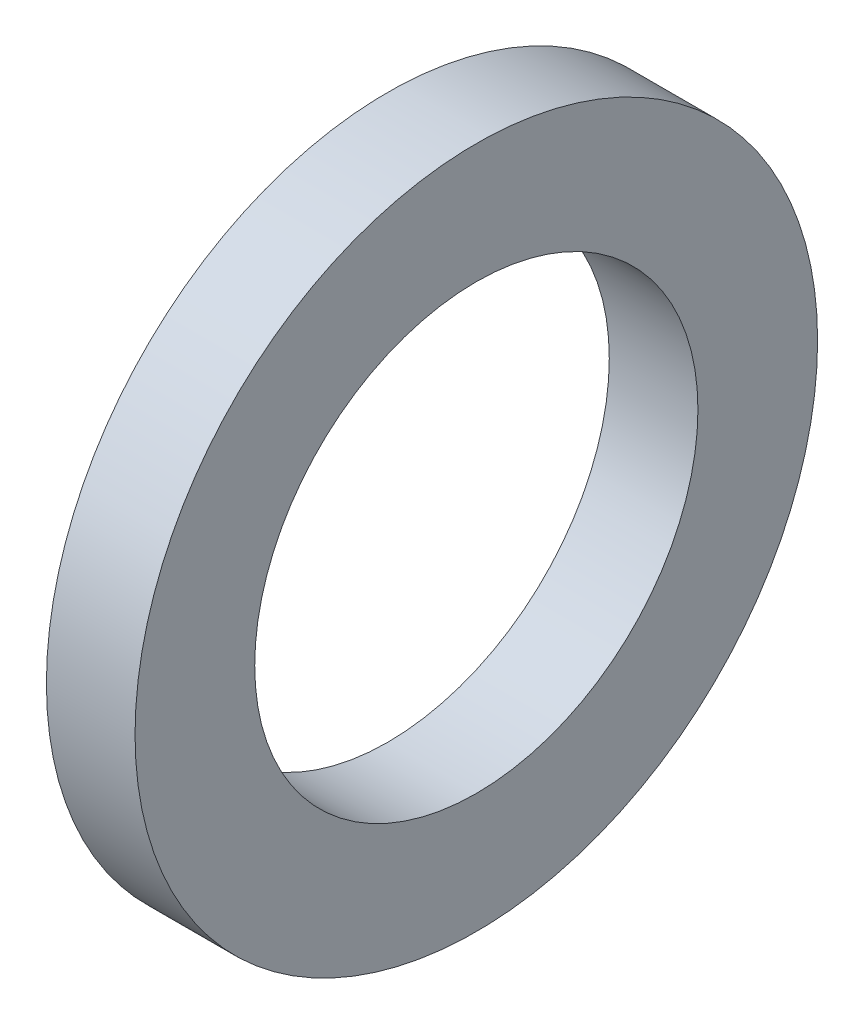
ISO-10303-21;
HEADER;
FILE_DESCRIPTION(('STEP AP214'),'2;1');
FILE_NAME('part.step','',(''),(''),'','','');
FILE_SCHEMA(('AUTOMOTIVE_DESIGN { 1 0 10303 214 1 1 1 1 }'));
ENDSEC;
DATA;
#1=APPLICATION_CONTEXT('core data for automotive mechanical design processes');
#2=APPLICATION_PROTOCOL_DEFINITION('international standard','automotive_design',2000,#1);
#3=PRODUCT_CONTEXT('',#1,'mechanical');
#4=PRODUCT('Part','Part','',(#3));
#5=PRODUCT_RELATED_PRODUCT_CATEGORY('part','',(#4));
#6=PRODUCT_DEFINITION_FORMATION('','',#4);
#7=PRODUCT_DEFINITION_CONTEXT('part definition',#1,'design');
#8=PRODUCT_DEFINITION('design','',#6,#7);
#9=PRODUCT_DEFINITION_SHAPE('','',#8);
#10=(LENGTH_UNIT() NAMED_UNIT(*) SI_UNIT(.MILLI.,.METRE.));
#11=(NAMED_UNIT(*) PLANE_ANGLE_UNIT() SI_UNIT($,.RADIAN.));
#12=(NAMED_UNIT(*) SI_UNIT($,.STERADIAN.) SOLID_ANGLE_UNIT());
#13=UNCERTAINTY_MEASURE_WITH_UNIT(LENGTH_MEASURE(1.E-05),#10,'distance_accuracy_value','');
#14=(GEOMETRIC_REPRESENTATION_CONTEXT(3) GLOBAL_UNCERTAINTY_ASSIGNED_CONTEXT((#13)) GLOBAL_UNIT_ASSIGNED_CONTEXT((#10,
#11,#12)) REPRESENTATION_CONTEXT('',''));
#15=CARTESIAN_POINT('',(0.,0.,0.));
#16=DIRECTION('',(0.,0.,1.));
#17=DIRECTION('',(1.,0.,0.));
#18=AXIS2_PLACEMENT_3D('',#15,#16,#17);
#19=CARTESIAN_POINT('',(-0.499999999999999,3.85,0.));
#20=DIRECTION('',(1.,0.,0.));
#21=DIRECTION('',(0.,0.,-1.));
#22=AXIS2_PLACEMENT_3D('',#19,#20,#21);
#23=PLANE('',#22);
#24=CARTESIAN_POINT('',(-0.499999999999999,0.,0.));
#25=DIRECTION('',(-1.,0.,0.));
#26=DIRECTION('',(0.,0.,1.));
#27=AXIS2_PLACEMENT_3D('',#24,#25,#26);
#28=CIRCLE('',#27,2.5);
#29=CARTESIAN_POINT('',(-0.499999999999999,0.,2.5));
#30=VERTEX_POINT('',#29);
#31=EDGE_CURVE('E10',#30,#30,#28,.T.);
#32=ORIENTED_EDGE('',*,*,#31,.F.);
#33=EDGE_LOOP('',(#32));
#34=FACE_BOUND('',#33,.T.);
#35=CARTESIAN_POINT('',(-0.5,0.,0.));
#36=DIRECTION('',(-1.,0.,0.));
#37=DIRECTION('',(0.,0.,1.));
#38=AXIS2_PLACEMENT_3D('',#35,#36,#37);
#39=CIRCLE('',#38,3.85);
#40=CARTESIAN_POINT('',(-0.5,0.,3.85));
#41=VERTEX_POINT('',#40);
#42=EDGE_CURVE('E45',#41,#41,#39,.T.);
#43=ORIENTED_EDGE('',*,*,#42,.T.);
#44=EDGE_LOOP('',(#43));
#45=FACE_BOUND('',#44,.T.);
#46=ADVANCED_FACE('F31',(#34,#45),#23,.F.);
#47=CARTESIAN_POINT('',(0.,0.,0.));
#48=DIRECTION('',(-1.,0.,0.));
#49=DIRECTION('',(0.,0.,1.));
#50=AXIS2_PLACEMENT_3D('',#47,#48,#49);
#51=CYLINDRICAL_SURFACE('',#50,2.5);
#52=CARTESIAN_POINT('',(0.499999999999999,0.,0.));
#53=DIRECTION('',(-1.,0.,0.));
#54=DIRECTION('',(0.,0.,1.));
#55=AXIS2_PLACEMENT_3D('',#52,#53,#54);
#56=CIRCLE('',#55,2.5);
#57=CARTESIAN_POINT('',(0.499999999999999,0.,2.5));
#58=VERTEX_POINT('',#57);
#59=EDGE_CURVE('E37',#58,#58,#56,.T.);
#60=ORIENTED_EDGE('',*,*,#59,.F.);
#61=EDGE_LOOP('',(#60));
#62=FACE_BOUND('',#61,.T.);
#63=ORIENTED_EDGE('',*,*,#31,.T.);
#64=EDGE_LOOP('',(#63));
#65=FACE_BOUND('',#64,.T.);
#66=ADVANCED_FACE('F60',(#62,#65),#51,.F.);
#67=CARTESIAN_POINT('',(0.499999999999999,2.5,0.));
#68=DIRECTION('',(-1.,0.,0.));
#69=DIRECTION('',(0.,0.,1.));
#70=AXIS2_PLACEMENT_3D('',#67,#68,#69);
#71=PLANE('',#70);
#72=CARTESIAN_POINT('',(0.5,0.,0.));
#73=DIRECTION('',(-1.,0.,0.));
#74=DIRECTION('',(0.,0.,1.));
#75=AXIS2_PLACEMENT_3D('',#72,#73,#74);
#76=CIRCLE('',#75,3.85);
#77=CARTESIAN_POINT('',(0.5,0.,3.85));
#78=VERTEX_POINT('',#77);
#79=EDGE_CURVE('E41',#78,#78,#76,.T.);
#80=ORIENTED_EDGE('',*,*,#79,.F.);
#81=EDGE_LOOP('',(#80));
#82=FACE_BOUND('',#81,.T.);
#83=ORIENTED_EDGE('',*,*,#59,.T.);
#84=EDGE_LOOP('',(#83));
#85=FACE_BOUND('',#84,.T.);
#86=ADVANCED_FACE('F55',(#82,#85),#71,.F.);
#87=CARTESIAN_POINT('',(0.,0.,0.));
#88=DIRECTION('',(-1.,0.,0.));
#89=DIRECTION('',(0.,0.,1.));
#90=AXIS2_PLACEMENT_3D('',#87,#88,#89);
#91=CYLINDRICAL_SURFACE('',#90,3.85);
#92=ORIENTED_EDGE('',*,*,#42,.F.);
#93=EDGE_LOOP('',(#92));
#94=FACE_BOUND('',#93,.T.);
#95=ORIENTED_EDGE('',*,*,#79,.T.);
#96=EDGE_LOOP('',(#95));
#97=FACE_BOUND('',#96,.T.);
#98=ADVANCED_FACE('F52',(#94,#97),#91,.T.);
#99=CLOSED_SHELL('',(#46,#66,#86,#98));
#100=MANIFOLD_SOLID_BREP('B2',#99);
#101=ADVANCED_BREP_SHAPE_REPRESENTATION('',(#18,#100),#14);
#102=SHAPE_DEFINITION_REPRESENTATION(#9,#101);
ENDSEC;
END-ISO-10303-21;
